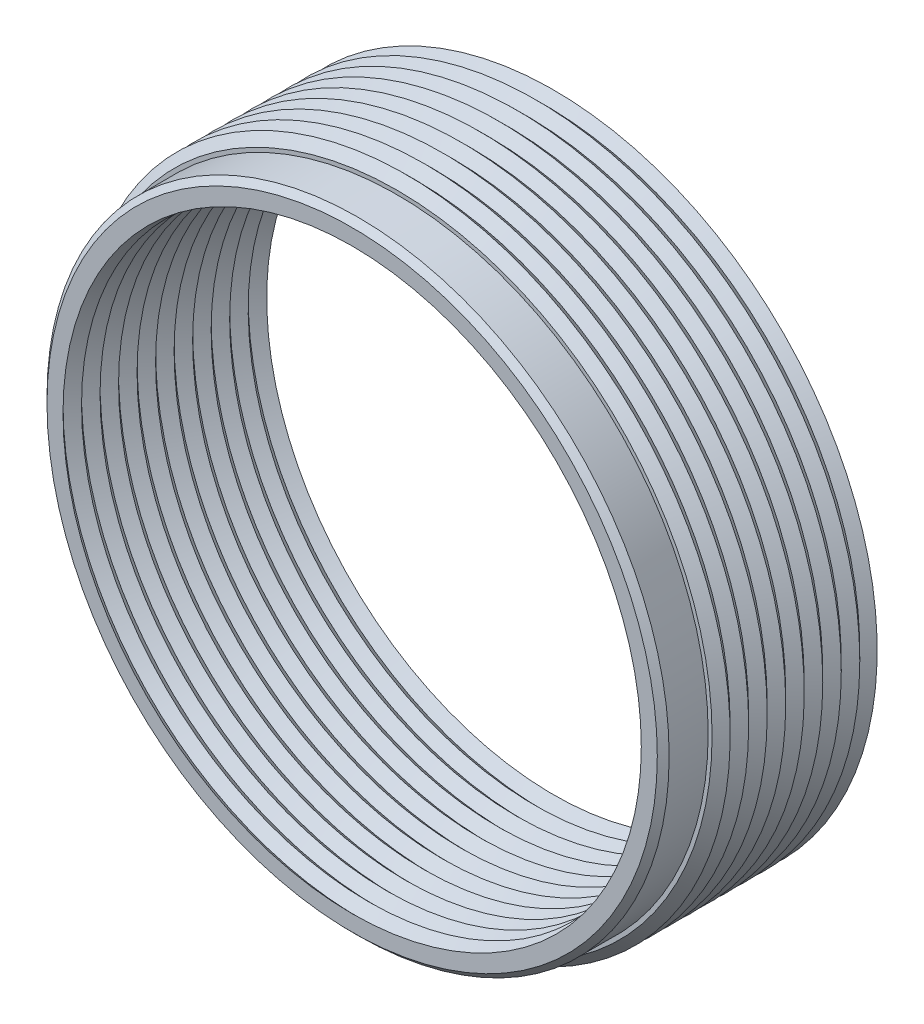
ISO-10303-21;
HEADER;
FILE_DESCRIPTION(('STEP AP214'),'2;1');
FILE_NAME('part.step','',(''),(''),'','','');
FILE_SCHEMA(('AUTOMOTIVE_DESIGN { 1 0 10303 214 1 1 1 1 }'));
ENDSEC;
DATA;
#1=APPLICATION_CONTEXT('core data for automotive mechanical design processes');
#2=APPLICATION_PROTOCOL_DEFINITION('international standard','automotive_design',2000,#1);
#3=PRODUCT_CONTEXT('',#1,'mechanical');
#4=PRODUCT('Part','Part','',(#3));
#5=PRODUCT_RELATED_PRODUCT_CATEGORY('part','',(#4));
#6=PRODUCT_DEFINITION_FORMATION('','',#4);
#7=PRODUCT_DEFINITION_CONTEXT('part definition',#1,'design');
#8=PRODUCT_DEFINITION('design','',#6,#7);
#9=PRODUCT_DEFINITION_SHAPE('','',#8);
#10=(LENGTH_UNIT() NAMED_UNIT(*) SI_UNIT(.MILLI.,.METRE.));
#11=(NAMED_UNIT(*) PLANE_ANGLE_UNIT() SI_UNIT($,.RADIAN.));
#12=(NAMED_UNIT(*) SI_UNIT($,.STERADIAN.) SOLID_ANGLE_UNIT());
#13=UNCERTAINTY_MEASURE_WITH_UNIT(LENGTH_MEASURE(1.E-05),#10,'distance_accuracy_value','');
#14=(GEOMETRIC_REPRESENTATION_CONTEXT(3) GLOBAL_UNCERTAINTY_ASSIGNED_CONTEXT((#13)) GLOBAL_UNIT_ASSIGNED_CONTEXT((#10,
#11,#12)) REPRESENTATION_CONTEXT('',''));
#15=CARTESIAN_POINT('',(0.,0.,0.));
#16=DIRECTION('',(0.,0.,1.));
#17=DIRECTION('',(1.,0.,0.));
#18=AXIS2_PLACEMENT_3D('',#15,#16,#17);
#19=CARTESIAN_POINT('',(0.,0.,8.33437499999999));
#20=DIRECTION('',(0.,0.,-1.));
#21=DIRECTION('',(-1.,0.,0.));
#22=AXIS2_PLACEMENT_3D('',#19,#20,#21);
#23=CONICAL_SURFACE('',#22,12.7,0.785398163397448);
#24=CARTESIAN_POINT('',(0.,0.,8.33437499999999));
#25=DIRECTION('',(0.,0.,1.));
#26=DIRECTION('',(1.,0.,0.));
#27=AXIS2_PLACEMENT_3D('',#24,#25,#26);
#28=CIRCLE('',#27,12.7);
#29=CARTESIAN_POINT('',(12.7,0.,8.33437499999999));
#30=VERTEX_POINT('',#29);
#31=EDGE_CURVE('E30',#30,#30,#28,.F.);
#32=ORIENTED_EDGE('',*,*,#31,.T.);
#33=EDGE_LOOP('',(#32));
#34=FACE_BOUND('',#33,.T.);
#35=CARTESIAN_POINT('',(0.,0.,8.63979999999999));
#36=DIRECTION('',(0.,0.,-1.));
#37=DIRECTION('',(-1.,0.,0.));
#38=AXIS2_PLACEMENT_3D('',#35,#36,#37);
#39=CIRCLE('',#38,12.394575);
#40=CARTESIAN_POINT('',(-12.394575,0.,8.63979999999999));
#41=VERTEX_POINT('',#40);
#42=EDGE_CURVE('E18',#41,#41,#39,.T.);
#43=ORIENTED_EDGE('',*,*,#42,.F.);
#44=EDGE_LOOP('',(#43));
#45=FACE_BOUND('',#44,.T.);
#46=ADVANCED_FACE('F15',(#34,#45),#23,.F.);
#47=CARTESIAN_POINT('',(0.,0.,8.33437499999999));
#48=DIRECTION('',(0.,0.,1.));
#49=DIRECTION('',(1.,0.,0.));
#50=AXIS2_PLACEMENT_3D('',#47,#48,#49);
#51=CONICAL_SURFACE('',#50,12.7,0.785398163397448);
#52=ORIENTED_EDGE('',*,*,#31,.F.);
#53=EDGE_LOOP('',(#52));
#54=FACE_BOUND('',#53,.T.);
#55=CARTESIAN_POINT('',(0.,0.,7.93749999999999));
#56=DIRECTION('',(0.,0.,-1.));
#57=DIRECTION('',(0.,1.,0.));
#58=AXIS2_PLACEMENT_3D('',#55,#56,#57);
#59=CIRCLE('',#58,12.303125);
#60=CARTESIAN_POINT('',(0.,12.303125,7.93749999999999));
#61=VERTEX_POINT('',#60);
#62=EDGE_CURVE('E44',#61,#61,#59,.T.);
#63=ORIENTED_EDGE('',*,*,#62,.T.);
#64=EDGE_LOOP('',(#63));
#65=FACE_BOUND('',#64,.T.);
#66=ADVANCED_FACE('F600',(#54,#65),#51,.F.);
#67=CARTESIAN_POINT('',(0.,0.,8.63979999999999));
#68=DIRECTION('',(0.,0.,1.));
#69=DIRECTION('',(1.,0.,0.));
#70=AXIS2_PLACEMENT_3D('',#67,#68,#69);
#71=PLANE('',#70);
#72=CARTESIAN_POINT('',(0.,0.,8.63979999999999));
#73=DIRECTION('',(0.,0.,-1.));
#74=DIRECTION('',(-1.,0.,0.));
#75=AXIS2_PLACEMENT_3D('',#72,#73,#74);
#76=CIRCLE('',#75,13.081);
#77=CARTESIAN_POINT('',(-13.081,0.,8.63979999999999));
#78=VERTEX_POINT('',#77);
#79=EDGE_CURVE('E41',#78,#78,#76,.T.);
#80=ORIENTED_EDGE('',*,*,#79,.F.);
#81=EDGE_LOOP('',(#80));
#82=FACE_BOUND('',#81,.T.);
#83=ORIENTED_EDGE('',*,*,#42,.T.);
#84=EDGE_LOOP('',(#83));
#85=FACE_BOUND('',#84,.T.);
#86=ADVANCED_FACE('F590',(#82,#85),#71,.T.);
#87=CARTESIAN_POINT('',(0.,0.,7.54062499999999));
#88=DIRECTION('',(0.,0.,-1.));
#89=DIRECTION('',(-1.,0.,0.));
#90=AXIS2_PLACEMENT_3D('',#87,#88,#89);
#91=CONICAL_SURFACE('',#90,12.7,0.785398163397448);
#92=CARTESIAN_POINT('',(0.,0.,7.54062499999999));
#93=DIRECTION('',(0.,0.,1.));
#94=DIRECTION('',(1.,0.,0.));
#95=AXIS2_PLACEMENT_3D('',#92,#93,#94);
#96=CIRCLE('',#95,12.7);
#97=CARTESIAN_POINT('',(12.7,0.,7.54062499999999));
#98=VERTEX_POINT('',#97);
#99=EDGE_CURVE('E43',#98,#98,#96,.F.);
#100=ORIENTED_EDGE('',*,*,#99,.T.);
#101=EDGE_LOOP('',(#100));
#102=FACE_BOUND('',#101,.T.);
#103=ORIENTED_EDGE('',*,*,#62,.F.);
#104=EDGE_LOOP('',(#103));
#105=FACE_BOUND('',#104,.T.);
#106=ADVANCED_FACE('F580',(#102,#105),#91,.F.);
#107=CARTESIAN_POINT('',(0.,0.,8.38579999999999));
#108=DIRECTION('',(0.,0.,-1.));
#109=DIRECTION('',(-1.,0.,0.));
#110=AXIS2_PLACEMENT_3D('',#107,#108,#109);
#111=CONICAL_SURFACE('',#110,13.335,0.785398163397445);
#112=CARTESIAN_POINT('',(0.,0.,8.38579999999999));
#113=DIRECTION('',(0.,0.,1.));
#114=DIRECTION('',(1.,0.,0.));
#115=AXIS2_PLACEMENT_3D('',#112,#113,#114);
#116=CIRCLE('',#115,13.335);
#117=CARTESIAN_POINT('',(13.335,0.,8.38579999999999));
#118=VERTEX_POINT('',#117);
#119=EDGE_CURVE('E48',#118,#118,#116,.F.);
#120=ORIENTED_EDGE('',*,*,#119,.F.);
#121=EDGE_LOOP('',(#120));
#122=FACE_BOUND('',#121,.T.);
#123=ORIENTED_EDGE('',*,*,#79,.T.);
#124=EDGE_LOOP('',(#123));
#125=FACE_BOUND('',#124,.T.);
#126=ADVANCED_FACE('F570',(#122,#125),#111,.T.);
#127=CARTESIAN_POINT('',(0.,0.,7.54062499999999));
#128=DIRECTION('',(0.,0.,1.));
#129=DIRECTION('',(1.,0.,0.));
#130=AXIS2_PLACEMENT_3D('',#127,#128,#129);
#131=CONICAL_SURFACE('',#130,12.7,0.785398163397448);
#132=ORIENTED_EDGE('',*,*,#99,.F.);
#133=EDGE_LOOP('',(#132));
#134=FACE_BOUND('',#133,.T.);
#135=CARTESIAN_POINT('',(0.,0.,7.14374999999999));
#136=DIRECTION('',(0.,0.,-1.));
#137=DIRECTION('',(0.,1.,0.));
#138=AXIS2_PLACEMENT_3D('',#135,#136,#137);
#139=CIRCLE('',#138,12.303125);
#140=CARTESIAN_POINT('',(0.,12.303125,7.14374999999999));
#141=VERTEX_POINT('',#140);
#142=EDGE_CURVE('E40',#141,#141,#139,.T.);
#143=ORIENTED_EDGE('',*,*,#142,.T.);
#144=EDGE_LOOP('',(#143));
#145=FACE_BOUND('',#144,.T.);
#146=ADVANCED_FACE('F560',(#134,#145),#131,.F.);
#147=CARTESIAN_POINT('',(0.,0.,6.71359999999999));
#148=DIRECTION('',(0.,0.,1.));
#149=DIRECTION('',(1.,0.,0.));
#150=AXIS2_PLACEMENT_3D('',#147,#148,#149);
#151=CYLINDRICAL_SURFACE('',#150,13.335);
#152=ORIENTED_EDGE('',*,*,#119,.T.);
#153=EDGE_LOOP('',(#152));
#154=FACE_BOUND('',#153,.T.);
#155=CARTESIAN_POINT('',(0.,0.,6.71359999999999));
#156=DIRECTION('',(0.,0.,1.));
#157=DIRECTION('',(1.,0.,0.));
#158=AXIS2_PLACEMENT_3D('',#155,#156,#157);
#159=CIRCLE('',#158,13.335);
#160=CARTESIAN_POINT('',(13.335,0.,6.71359999999999));
#161=VERTEX_POINT('',#160);
#162=EDGE_CURVE('E38',#161,#161,#159,.F.);
#163=ORIENTED_EDGE('',*,*,#162,.F.);
#164=EDGE_LOOP('',(#163));
#165=FACE_BOUND('',#164,.T.);
#166=ADVANCED_FACE('F550',(#154,#165),#151,.T.);
#167=CARTESIAN_POINT('',(0.,0.,6.74687499999999));
#168=DIRECTION('',(0.,0.,-1.));
#169=DIRECTION('',(0.,1.,0.));
#170=AXIS2_PLACEMENT_3D('',#167,#168,#169);
#171=CONICAL_SURFACE('',#170,12.7,0.785398163397447);
#172=CARTESIAN_POINT('',(0.,0.,6.74687499999999));
#173=DIRECTION('',(0.,0.,1.));
#174=DIRECTION('',(1.,0.,0.));
#175=AXIS2_PLACEMENT_3D('',#172,#173,#174);
#176=CIRCLE('',#175,12.7);
#177=CARTESIAN_POINT('',(12.7,0.,6.74687499999999));
#178=VERTEX_POINT('',#177);
#179=EDGE_CURVE('E37',#178,#178,#176,.F.);
#180=ORIENTED_EDGE('',*,*,#179,.T.);
#181=EDGE_LOOP('',(#180));
#182=FACE_BOUND('',#181,.T.);
#183=ORIENTED_EDGE('',*,*,#142,.F.);
#184=EDGE_LOOP('',(#183));
#185=FACE_BOUND('',#184,.T.);
#186=ADVANCED_FACE('F540',(#182,#185),#171,.F.);
#187=CARTESIAN_POINT('',(0.,0.,6.71359999999999));
#188=DIRECTION('',(0.,0.,1.));
#189=DIRECTION('',(1.,0.,0.));
#190=AXIS2_PLACEMENT_3D('',#187,#188,#189);
#191=PLANE('',#190);
#192=ORIENTED_EDGE('',*,*,#162,.T.);
#193=EDGE_LOOP('',(#192));
#194=FACE_BOUND('',#193,.T.);
#195=CARTESIAN_POINT('',(0.,0.,6.71359999999999));
#196=DIRECTION('',(0.,0.,-1.));
#197=DIRECTION('',(-1.,0.,0.));
#198=AXIS2_PLACEMENT_3D('',#195,#196,#197);
#199=CIRCLE('',#198,13.503275);
#200=CARTESIAN_POINT('',(-13.503275,0.,6.71359999999999));
#201=VERTEX_POINT('',#200);
#202=EDGE_CURVE('E33',#201,#201,#199,.T.);
#203=ORIENTED_EDGE('',*,*,#202,.F.);
#204=EDGE_LOOP('',(#203));
#205=FACE_BOUND('',#204,.T.);
#206=ADVANCED_FACE('F530',(#194,#205),#191,.T.);
#207=CARTESIAN_POINT('',(0.,0.,6.74687499999999));
#208=DIRECTION('',(0.,0.,1.));
#209=DIRECTION('',(1.,0.,0.));
#210=AXIS2_PLACEMENT_3D('',#207,#208,#209);
#211=CONICAL_SURFACE('',#210,12.7,0.785398163397448);
#212=ORIENTED_EDGE('',*,*,#179,.F.);
#213=EDGE_LOOP('',(#212));
#214=FACE_BOUND('',#213,.T.);
#215=CARTESIAN_POINT('',(0.,0.,6.34999999999999));
#216=DIRECTION('',(0.,0.,-1.));
#217=DIRECTION('',(-1.,0.,0.));
#218=AXIS2_PLACEMENT_3D('',#215,#216,#217);
#219=CIRCLE('',#218,12.303125);
#220=CARTESIAN_POINT('',(-12.303125,0.,6.34999999999999));
#221=VERTEX_POINT('',#220);
#222=EDGE_CURVE('E36',#221,#221,#219,.T.);
#223=ORIENTED_EDGE('',*,*,#222,.T.);
#224=EDGE_LOOP('',(#223));
#225=FACE_BOUND('',#224,.T.);
#226=ADVANCED_FACE('F520',(#214,#225),#211,.F.);
#227=CARTESIAN_POINT('',(0.,0.,6.32625));
#228=DIRECTION('',(0.,0.,-1.));
#229=DIRECTION('',(-1.,0.,0.));
#230=AXIS2_PLACEMENT_3D('',#227,#228,#229);
#231=CONICAL_SURFACE('',#230,13.890625,0.78539816339745);
#232=ORIENTED_EDGE('',*,*,#202,.T.);
#233=EDGE_LOOP('',(#232));
#234=FACE_BOUND('',#233,.T.);
#235=CARTESIAN_POINT('',(0.,0.,6.32625));
#236=DIRECTION('',(0.,0.,1.));
#237=DIRECTION('',(0.,-1.,0.));
#238=AXIS2_PLACEMENT_3D('',#235,#236,#237);
#239=CIRCLE('',#238,13.890625);
#240=CARTESIAN_POINT('',(0.,-13.890625,6.32625));
#241=VERTEX_POINT('',#240);
#242=EDGE_CURVE('E63',#241,#241,#239,.F.);
#243=ORIENTED_EDGE('',*,*,#242,.F.);
#244=EDGE_LOOP('',(#243));
#245=FACE_BOUND('',#244,.T.);
#246=ADVANCED_FACE('F510',(#234,#245),#231,.T.);
#247=CARTESIAN_POINT('',(0.,0.,5.95312499999999));
#248=DIRECTION('',(0.,0.,-1.));
#249=DIRECTION('',(-1.,0.,0.));
#250=AXIS2_PLACEMENT_3D('',#247,#248,#249);
#251=CONICAL_SURFACE('',#250,12.7,0.785398163397446);
#252=CARTESIAN_POINT('',(0.,0.,5.95312499999999));
#253=DIRECTION('',(0.,0.,1.));
#254=DIRECTION('',(1.,0.,0.));
#255=AXIS2_PLACEMENT_3D('',#252,#253,#254);
#256=CIRCLE('',#255,12.7);
#257=CARTESIAN_POINT('',(12.7,0.,5.95312499999999));
#258=VERTEX_POINT('',#257);
#259=EDGE_CURVE('E66',#258,#258,#256,.F.);
#260=ORIENTED_EDGE('',*,*,#259,.T.);
#261=EDGE_LOOP('',(#260));
#262=FACE_BOUND('',#261,.T.);
#263=ORIENTED_EDGE('',*,*,#222,.F.);
#264=EDGE_LOOP('',(#263));
#265=FACE_BOUND('',#264,.T.);
#266=ADVANCED_FACE('F500',(#262,#265),#251,.F.);
#267=CARTESIAN_POINT('',(0.,0.,6.32625));
#268=DIRECTION('',(0.,0.,1.));
#269=DIRECTION('',(1.,0.,0.));
#270=AXIS2_PLACEMENT_3D('',#267,#268,#269);
#271=CONICAL_SURFACE('',#270,13.890625,0.785398163397457);
#272=ORIENTED_EDGE('',*,*,#242,.T.);
#273=EDGE_LOOP('',(#272));
#274=FACE_BOUND('',#273,.T.);
#275=CARTESIAN_POINT('',(0.,0.,5.929375));
#276=DIRECTION('',(0.,0.,-1.));
#277=DIRECTION('',(0.,1.,0.));
#278=AXIS2_PLACEMENT_3D('',#275,#276,#277);
#279=CIRCLE('',#278,13.49375);
#280=CARTESIAN_POINT('',(0.,13.49375,5.929375));
#281=VERTEX_POINT('',#280);
#282=EDGE_CURVE('E69',#281,#281,#279,.T.);
#283=ORIENTED_EDGE('',*,*,#282,.F.);
#284=EDGE_LOOP('',(#283));
#285=FACE_BOUND('',#284,.T.);
#286=ADVANCED_FACE('F490',(#274,#285),#271,.T.);
#287=CARTESIAN_POINT('',(0.,0.,5.95312499999999));
#288=DIRECTION('',(0.,0.,1.));
#289=DIRECTION('',(1.,0.,0.));
#290=AXIS2_PLACEMENT_3D('',#287,#288,#289);
#291=CONICAL_SURFACE('',#290,12.7,0.785398163397447);
#292=ORIENTED_EDGE('',*,*,#259,.F.);
#293=EDGE_LOOP('',(#292));
#294=FACE_BOUND('',#293,.T.);
#295=CARTESIAN_POINT('',(0.,0.,5.55624999999999));
#296=DIRECTION('',(0.,0.,-1.));
#297=DIRECTION('',(-1.,0.,0.));
#298=AXIS2_PLACEMENT_3D('',#295,#296,#297);
#299=CIRCLE('',#298,12.303125);
#300=CARTESIAN_POINT('',(-12.303125,0.,5.55624999999999));
#301=VERTEX_POINT('',#300);
#302=EDGE_CURVE('E72',#301,#301,#299,.T.);
#303=ORIENTED_EDGE('',*,*,#302,.T.);
#304=EDGE_LOOP('',(#303));
#305=FACE_BOUND('',#304,.T.);
#306=ADVANCED_FACE('F480',(#294,#305),#291,.F.);
#307=CARTESIAN_POINT('',(0.,0.,5.5325));
#308=DIRECTION('',(0.,0.,-1.));
#309=DIRECTION('',(0.,1.,0.));
#310=AXIS2_PLACEMENT_3D('',#307,#308,#309);
#311=CONICAL_SURFACE('',#310,13.890625,0.785398163397448);
#312=CARTESIAN_POINT('',(0.,0.,5.53249999999999));
#313=DIRECTION('',(0.,0.,1.));
#314=DIRECTION('',(1.,0.,0.));
#315=AXIS2_PLACEMENT_3D('',#312,#313,#314);
#316=CIRCLE('',#315,13.890625);
#317=CARTESIAN_POINT('',(13.890625,0.,5.53249999999999));
#318=VERTEX_POINT('',#317);
#319=EDGE_CURVE('E75',#318,#318,#316,.F.);
#320=ORIENTED_EDGE('',*,*,#319,.F.);
#321=EDGE_LOOP('',(#320));
#322=FACE_BOUND('',#321,.T.);
#323=ORIENTED_EDGE('',*,*,#282,.T.);
#324=EDGE_LOOP('',(#323));
#325=FACE_BOUND('',#324,.T.);
#326=ADVANCED_FACE('F470',(#322,#325),#311,.T.);
#327=CARTESIAN_POINT('',(0.,0.,5.15937499999999));
#328=DIRECTION('',(0.,0.,-1.));
#329=DIRECTION('',(-1.,0.,0.));
#330=AXIS2_PLACEMENT_3D('',#327,#328,#329);
#331=CONICAL_SURFACE('',#330,12.7,0.785398163397449);
#332=CARTESIAN_POINT('',(0.,0.,5.15937499999999));
#333=DIRECTION('',(0.,0.,1.));
#334=DIRECTION('',(1.,0.,0.));
#335=AXIS2_PLACEMENT_3D('',#332,#333,#334);
#336=CIRCLE('',#335,12.7);
#337=CARTESIAN_POINT('',(12.7,0.,5.15937499999999));
#338=VERTEX_POINT('',#337);
#339=EDGE_CURVE('E78',#338,#338,#336,.F.);
#340=ORIENTED_EDGE('',*,*,#339,.T.);
#341=EDGE_LOOP('',(#340));
#342=FACE_BOUND('',#341,.T.);
#343=ORIENTED_EDGE('',*,*,#302,.F.);
#344=EDGE_LOOP('',(#343));
#345=FACE_BOUND('',#344,.T.);
#346=ADVANCED_FACE('F460',(#342,#345),#331,.F.);
#347=CARTESIAN_POINT('',(0.,0.,5.5325));
#348=DIRECTION('',(0.,0.,1.));
#349=DIRECTION('',(1.,0.,0.));
#350=AXIS2_PLACEMENT_3D('',#347,#348,#349);
#351=CONICAL_SURFACE('',#350,13.890625,0.785398163397457);
#352=ORIENTED_EDGE('',*,*,#319,.T.);
#353=EDGE_LOOP('',(#352));
#354=FACE_BOUND('',#353,.T.);
#355=CARTESIAN_POINT('',(0.,0.,5.135625));
#356=DIRECTION('',(0.,0.,-1.));
#357=DIRECTION('',(-1.,0.,0.));
#358=AXIS2_PLACEMENT_3D('',#355,#356,#357);
#359=CIRCLE('',#358,13.49375);
#360=CARTESIAN_POINT('',(-13.49375,0.,5.135625));
#361=VERTEX_POINT('',#360);
#362=EDGE_CURVE('E81',#361,#361,#359,.T.);
#363=ORIENTED_EDGE('',*,*,#362,.F.);
#364=EDGE_LOOP('',(#363));
#365=FACE_BOUND('',#364,.T.);
#366=ADVANCED_FACE('F450',(#354,#365),#351,.T.);
#367=CARTESIAN_POINT('',(0.,0.,5.15937499999999));
#368=DIRECTION('',(0.,0.,1.));
#369=DIRECTION('',(1.,0.,0.));
#370=AXIS2_PLACEMENT_3D('',#367,#368,#369);
#371=CONICAL_SURFACE('',#370,12.7,0.785398163397449);
#372=ORIENTED_EDGE('',*,*,#339,.F.);
#373=EDGE_LOOP('',(#372));
#374=FACE_BOUND('',#373,.T.);
#375=CARTESIAN_POINT('',(0.,0.,4.76249999999999));
#376=DIRECTION('',(0.,0.,-1.));
#377=DIRECTION('',(-1.,0.,0.));
#378=AXIS2_PLACEMENT_3D('',#375,#376,#377);
#379=CIRCLE('',#378,12.303125);
#380=CARTESIAN_POINT('',(-12.303125,0.,4.76249999999999));
#381=VERTEX_POINT('',#380);
#382=EDGE_CURVE('E84',#381,#381,#379,.T.);
#383=ORIENTED_EDGE('',*,*,#382,.T.);
#384=EDGE_LOOP('',(#383));
#385=FACE_BOUND('',#384,.T.);
#386=ADVANCED_FACE('F440',(#374,#385),#371,.F.);
#387=CARTESIAN_POINT('',(0.,0.,4.73875));
#388=DIRECTION('',(0.,0.,-1.));
#389=DIRECTION('',(-1.,0.,0.));
#390=AXIS2_PLACEMENT_3D('',#387,#388,#389);
#391=CONICAL_SURFACE('',#390,13.890625,0.78539816339745);
#392=CARTESIAN_POINT('',(0.,0.,4.73875));
#393=DIRECTION('',(0.,0.,1.));
#394=DIRECTION('',(1.,0.,0.));
#395=AXIS2_PLACEMENT_3D('',#392,#393,#394);
#396=CIRCLE('',#395,13.890625);
#397=CARTESIAN_POINT('',(13.890625,0.,4.73875));
#398=VERTEX_POINT('',#397);
#399=EDGE_CURVE('E87',#398,#398,#396,.F.);
#400=ORIENTED_EDGE('',*,*,#399,.F.);
#401=EDGE_LOOP('',(#400));
#402=FACE_BOUND('',#401,.T.);
#403=ORIENTED_EDGE('',*,*,#362,.T.);
#404=EDGE_LOOP('',(#403));
#405=FACE_BOUND('',#404,.T.);
#406=ADVANCED_FACE('F430',(#402,#405),#391,.T.);
#407=CARTESIAN_POINT('',(0.,0.,4.36562499999999));
#408=DIRECTION('',(0.,0.,-1.));
#409=DIRECTION('',(-1.,0.,0.));
#410=AXIS2_PLACEMENT_3D('',#407,#408,#409);
#411=CONICAL_SURFACE('',#410,12.7,0.785398163397449);
#412=CARTESIAN_POINT('',(0.,0.,4.36562499999999));
#413=DIRECTION('',(0.,0.,1.));
#414=DIRECTION('',(1.,0.,0.));
#415=AXIS2_PLACEMENT_3D('',#412,#413,#414);
#416=CIRCLE('',#415,12.7);
#417=CARTESIAN_POINT('',(12.7,0.,4.36562499999999));
#418=VERTEX_POINT('',#417);
#419=EDGE_CURVE('E90',#418,#418,#416,.F.);
#420=ORIENTED_EDGE('',*,*,#419,.T.);
#421=EDGE_LOOP('',(#420));
#422=FACE_BOUND('',#421,.T.);
#423=ORIENTED_EDGE('',*,*,#382,.F.);
#424=EDGE_LOOP('',(#423));
#425=FACE_BOUND('',#424,.T.);
#426=ADVANCED_FACE('F420',(#422,#425),#411,.F.);
#427=CARTESIAN_POINT('',(0.,0.,4.73874999999999));
#428=DIRECTION('',(0.,0.,1.));
#429=DIRECTION('',(1.,0.,0.));
#430=AXIS2_PLACEMENT_3D('',#427,#428,#429);
#431=CONICAL_SURFACE('',#430,13.890625,0.785398163397456);
#432=ORIENTED_EDGE('',*,*,#399,.T.);
#433=EDGE_LOOP('',(#432));
#434=FACE_BOUND('',#433,.T.);
#435=CARTESIAN_POINT('',(0.,0.,4.341875));
#436=DIRECTION('',(0.,0.,-1.));
#437=DIRECTION('',(-1.,0.,0.));
#438=AXIS2_PLACEMENT_3D('',#435,#436,#437);
#439=CIRCLE('',#438,13.49375);
#440=CARTESIAN_POINT('',(-13.49375,0.,4.341875));
#441=VERTEX_POINT('',#440);
#442=EDGE_CURVE('E93',#441,#441,#439,.T.);
#443=ORIENTED_EDGE('',*,*,#442,.F.);
#444=EDGE_LOOP('',(#443));
#445=FACE_BOUND('',#444,.T.);
#446=ADVANCED_FACE('F410',(#434,#445),#431,.T.);
#447=CARTESIAN_POINT('',(0.,0.,4.36562499999999));
#448=DIRECTION('',(0.,0.,1.));
#449=DIRECTION('',(1.,0.,0.));
#450=AXIS2_PLACEMENT_3D('',#447,#448,#449);
#451=CONICAL_SURFACE('',#450,12.7,0.785398163397449);
#452=ORIENTED_EDGE('',*,*,#419,.F.);
#453=EDGE_LOOP('',(#452));
#454=FACE_BOUND('',#453,.T.);
#455=CARTESIAN_POINT('',(0.,0.,3.96874999999999));
#456=DIRECTION('',(0.,0.,-1.));
#457=DIRECTION('',(-1.,0.,0.));
#458=AXIS2_PLACEMENT_3D('',#455,#456,#457);
#459=CIRCLE('',#458,12.303125);
#460=CARTESIAN_POINT('',(-12.303125,0.,3.96874999999999));
#461=VERTEX_POINT('',#460);
#462=EDGE_CURVE('E96',#461,#461,#459,.T.);
#463=ORIENTED_EDGE('',*,*,#462,.T.);
#464=EDGE_LOOP('',(#463));
#465=FACE_BOUND('',#464,.T.);
#466=ADVANCED_FACE('F400',(#454,#465),#451,.F.);
#467=CARTESIAN_POINT('',(0.,0.,3.94499999999999));
#468=DIRECTION('',(0.,0.,-1.));
#469=DIRECTION('',(0.,1.,0.));
#470=AXIS2_PLACEMENT_3D('',#467,#468,#469);
#471=CONICAL_SURFACE('',#470,13.890625,0.785398163397449);
#472=CARTESIAN_POINT('',(0.,0.,3.94499999999999));
#473=DIRECTION('',(0.,0.,1.));
#474=DIRECTION('',(0.,-1.,0.));
#475=AXIS2_PLACEMENT_3D('',#472,#473,#474);
#476=CIRCLE('',#475,13.890625);
#477=CARTESIAN_POINT('',(0.,-13.890625,3.94499999999999));
#478=VERTEX_POINT('',#477);
#479=EDGE_CURVE('E99',#478,#478,#476,.F.);
#480=ORIENTED_EDGE('',*,*,#479,.F.);
#481=EDGE_LOOP('',(#480));
#482=FACE_BOUND('',#481,.T.);
#483=ORIENTED_EDGE('',*,*,#442,.T.);
#484=EDGE_LOOP('',(#483));
#485=FACE_BOUND('',#484,.T.);
#486=ADVANCED_FACE('F390',(#482,#485),#471,.T.);
#487=CARTESIAN_POINT('',(0.,0.,3.57187499999999));
#488=DIRECTION('',(0.,0.,-1.));
#489=DIRECTION('',(0.,1.,0.));
#490=AXIS2_PLACEMENT_3D('',#487,#488,#489);
#491=CONICAL_SURFACE('',#490,12.7,0.785398163397449);
#492=CARTESIAN_POINT('',(0.,0.,3.57187499999999));
#493=DIRECTION('',(0.,0.,1.));
#494=DIRECTION('',(0.,-1.,0.));
#495=AXIS2_PLACEMENT_3D('',#492,#493,#494);
#496=CIRCLE('',#495,12.7);
#497=CARTESIAN_POINT('',(0.,-12.7,3.57187499999999));
#498=VERTEX_POINT('',#497);
#499=EDGE_CURVE('E102',#498,#498,#496,.F.);
#500=ORIENTED_EDGE('',*,*,#499,.T.);
#501=EDGE_LOOP('',(#500));
#502=FACE_BOUND('',#501,.T.);
#503=ORIENTED_EDGE('',*,*,#462,.F.);
#504=EDGE_LOOP('',(#503));
#505=FACE_BOUND('',#504,.T.);
#506=ADVANCED_FACE('F380',(#502,#505),#491,.F.);
#507=CARTESIAN_POINT('',(0.,0.,3.945));
#508=DIRECTION('',(0.,0.,1.));
#509=DIRECTION('',(0.,-1.,0.));
#510=AXIS2_PLACEMENT_3D('',#507,#508,#509);
#511=CONICAL_SURFACE('',#510,13.890625,0.785398163397458);
#512=CARTESIAN_POINT('',(0.,0.,3.548125));
#513=DIRECTION('',(0.,0.,-1.));
#514=DIRECTION('',(-1.,0.,0.));
#515=AXIS2_PLACEMENT_3D('',#512,#513,#514);
#516=CIRCLE('',#515,13.49375);
#517=CARTESIAN_POINT('',(-13.49375,0.,3.548125));
#518=VERTEX_POINT('',#517);
#519=EDGE_CURVE('E105',#518,#518,#516,.T.);
#520=ORIENTED_EDGE('',*,*,#519,.F.);
#521=EDGE_LOOP('',(#520));
#522=FACE_BOUND('',#521,.T.);
#523=ORIENTED_EDGE('',*,*,#479,.T.);
#524=EDGE_LOOP('',(#523));
#525=FACE_BOUND('',#524,.T.);
#526=ADVANCED_FACE('F370',(#522,#525),#511,.T.);
#527=CARTESIAN_POINT('',(0.,0.,3.57187499999999));
#528=DIRECTION('',(0.,0.,1.));
#529=DIRECTION('',(1.,0.,0.));
#530=AXIS2_PLACEMENT_3D('',#527,#528,#529);
#531=CONICAL_SURFACE('',#530,12.7,0.785398163397448);
#532=CARTESIAN_POINT('',(0.,0.,3.17499999999999));
#533=DIRECTION('',(0.,0.,-1.));
#534=DIRECTION('',(-1.,0.,0.));
#535=AXIS2_PLACEMENT_3D('',#532,#533,#534);
#536=CIRCLE('',#535,12.303125);
#537=CARTESIAN_POINT('',(-12.303125,0.,3.17499999999999));
#538=VERTEX_POINT('',#537);
#539=EDGE_CURVE('E108',#538,#538,#536,.T.);
#540=ORIENTED_EDGE('',*,*,#539,.T.);
#541=EDGE_LOOP('',(#540));
#542=FACE_BOUND('',#541,.T.);
#543=ORIENTED_EDGE('',*,*,#499,.F.);
#544=EDGE_LOOP('',(#543));
#545=FACE_BOUND('',#544,.T.);
#546=ADVANCED_FACE('F360',(#542,#545),#531,.F.);
#547=CARTESIAN_POINT('',(0.,0.,3.15124999999999));
#548=DIRECTION('',(0.,0.,-1.));
#549=DIRECTION('',(0.,1.,0.));
#550=AXIS2_PLACEMENT_3D('',#547,#548,#549);
#551=CONICAL_SURFACE('',#550,13.890625,0.785398163397448);
#552=CARTESIAN_POINT('',(0.,0.,3.15125));
#553=DIRECTION('',(0.,0.,1.));
#554=DIRECTION('',(0.,-1.,0.));
#555=AXIS2_PLACEMENT_3D('',#552,#553,#554);
#556=CIRCLE('',#555,13.890625);
#557=CARTESIAN_POINT('',(0.,-13.890625,3.15125));
#558=VERTEX_POINT('',#557);
#559=EDGE_CURVE('E111',#558,#558,#556,.F.);
#560=ORIENTED_EDGE('',*,*,#559,.F.);
#561=EDGE_LOOP('',(#560));
#562=FACE_BOUND('',#561,.T.);
#563=ORIENTED_EDGE('',*,*,#519,.T.);
#564=EDGE_LOOP('',(#563));
#565=FACE_BOUND('',#564,.T.);
#566=ADVANCED_FACE('F350',(#562,#565),#551,.T.);
#567=CARTESIAN_POINT('',(0.,0.,2.77812499999999));
#568=DIRECTION('',(0.,0.,-1.));
#569=DIRECTION('',(-1.,0.,0.));
#570=AXIS2_PLACEMENT_3D('',#567,#568,#569);
#571=CONICAL_SURFACE('',#570,12.7,0.785398163397449);
#572=CARTESIAN_POINT('',(0.,0.,2.77812499999999));
#573=DIRECTION('',(0.,0.,1.));
#574=DIRECTION('',(1.,0.,0.));
#575=AXIS2_PLACEMENT_3D('',#572,#573,#574);
#576=CIRCLE('',#575,12.7);
#577=CARTESIAN_POINT('',(12.7,0.,2.77812499999999));
#578=VERTEX_POINT('',#577);
#579=EDGE_CURVE('E114',#578,#578,#576,.F.);
#580=ORIENTED_EDGE('',*,*,#579,.T.);
#581=EDGE_LOOP('',(#580));
#582=FACE_BOUND('',#581,.T.);
#583=ORIENTED_EDGE('',*,*,#539,.F.);
#584=EDGE_LOOP('',(#583));
#585=FACE_BOUND('',#584,.T.);
#586=ADVANCED_FACE('F340',(#582,#585),#571,.F.);
#587=CARTESIAN_POINT('',(0.,0.,3.15125));
#588=DIRECTION('',(0.,0.,1.));
#589=DIRECTION('',(0.,-1.,0.));
#590=AXIS2_PLACEMENT_3D('',#587,#588,#589);
#591=CONICAL_SURFACE('',#590,13.890625,0.785398163397457);
#592=CARTESIAN_POINT('',(0.,0.,2.754375));
#593=DIRECTION('',(0.,0.,-1.));
#594=DIRECTION('',(-1.,0.,0.));
#595=AXIS2_PLACEMENT_3D('',#592,#593,#594);
#596=CIRCLE('',#595,13.49375);
#597=CARTESIAN_POINT('',(-13.49375,0.,2.754375));
#598=VERTEX_POINT('',#597);
#599=EDGE_CURVE('E117',#598,#598,#596,.T.);
#600=ORIENTED_EDGE('',*,*,#599,.F.);
#601=EDGE_LOOP('',(#600));
#602=FACE_BOUND('',#601,.T.);
#603=ORIENTED_EDGE('',*,*,#559,.T.);
#604=EDGE_LOOP('',(#603));
#605=FACE_BOUND('',#604,.T.);
#606=ADVANCED_FACE('F330',(#602,#605),#591,.T.);
#607=CARTESIAN_POINT('',(0.,0.,2.77812499999999));
#608=DIRECTION('',(0.,0.,1.));
#609=DIRECTION('',(1.,0.,0.));
#610=AXIS2_PLACEMENT_3D('',#607,#608,#609);
#611=CONICAL_SURFACE('',#610,12.7,0.785398163397448);
#612=ORIENTED_EDGE('',*,*,#579,.F.);
#613=EDGE_LOOP('',(#612));
#614=FACE_BOUND('',#613,.T.);
#615=CARTESIAN_POINT('',(0.,0.,2.38124999999999));
#616=DIRECTION('',(0.,0.,-1.));
#617=DIRECTION('',(-1.,0.,0.));
#618=AXIS2_PLACEMENT_3D('',#615,#616,#617);
#619=CIRCLE('',#618,12.303125);
#620=CARTESIAN_POINT('',(-12.303125,0.,2.38124999999999));
#621=VERTEX_POINT('',#620);
#622=EDGE_CURVE('E120',#621,#621,#619,.T.);
#623=ORIENTED_EDGE('',*,*,#622,.T.);
#624=EDGE_LOOP('',(#623));
#625=FACE_BOUND('',#624,.T.);
#626=ADVANCED_FACE('F320',(#614,#625),#611,.F.);
#627=CARTESIAN_POINT('',(0.,0.,2.35749999999999));
#628=DIRECTION('',(0.,0.,-1.));
#629=DIRECTION('',(-1.,0.,0.));
#630=AXIS2_PLACEMENT_3D('',#627,#628,#629);
#631=CONICAL_SURFACE('',#630,13.890625,0.785398163397448);
#632=ORIENTED_EDGE('',*,*,#599,.T.);
#633=EDGE_LOOP('',(#632));
#634=FACE_BOUND('',#633,.T.);
#635=CARTESIAN_POINT('',(0.,0.,2.3575));
#636=DIRECTION('',(0.,0.,1.));
#637=DIRECTION('',(1.,0.,0.));
#638=AXIS2_PLACEMENT_3D('',#635,#636,#637);
#639=CIRCLE('',#638,13.890625);
#640=CARTESIAN_POINT('',(13.890625,0.,2.3575));
#641=VERTEX_POINT('',#640);
#642=EDGE_CURVE('E123',#641,#641,#639,.F.);
#643=ORIENTED_EDGE('',*,*,#642,.F.);
#644=EDGE_LOOP('',(#643));
#645=FACE_BOUND('',#644,.T.);
#646=ADVANCED_FACE('F310',(#634,#645),#631,.T.);
#647=CARTESIAN_POINT('',(0.,0.,1.98437499999999));
#648=DIRECTION('',(0.,0.,-1.));
#649=DIRECTION('',(-1.,0.,0.));
#650=AXIS2_PLACEMENT_3D('',#647,#648,#649);
#651=CONICAL_SURFACE('',#650,12.7,0.785398163397448);
#652=CARTESIAN_POINT('',(0.,0.,1.98437499999999));
#653=DIRECTION('',(0.,0.,1.));
#654=DIRECTION('',(1.,0.,0.));
#655=AXIS2_PLACEMENT_3D('',#652,#653,#654);
#656=CIRCLE('',#655,12.7);
#657=CARTESIAN_POINT('',(12.7,0.,1.98437499999999));
#658=VERTEX_POINT('',#657);
#659=EDGE_CURVE('E126',#658,#658,#656,.F.);
#660=ORIENTED_EDGE('',*,*,#659,.T.);
#661=EDGE_LOOP('',(#660));
#662=FACE_BOUND('',#661,.T.);
#663=ORIENTED_EDGE('',*,*,#622,.F.);
#664=EDGE_LOOP('',(#663));
#665=FACE_BOUND('',#664,.T.);
#666=ADVANCED_FACE('F300',(#662,#665),#651,.F.);
#667=CARTESIAN_POINT('',(0.,0.,2.3575));
#668=DIRECTION('',(0.,0.,1.));
#669=DIRECTION('',(1.,0.,0.));
#670=AXIS2_PLACEMENT_3D('',#667,#668,#669);
#671=CONICAL_SURFACE('',#670,13.890625,0.785398163397456);
#672=CARTESIAN_POINT('',(0.,0.,1.960625));
#673=DIRECTION('',(0.,0.,-1.));
#674=DIRECTION('',(-1.,0.,0.));
#675=AXIS2_PLACEMENT_3D('',#672,#673,#674);
#676=CIRCLE('',#675,13.49375);
#677=CARTESIAN_POINT('',(-13.49375,0.,1.960625));
#678=VERTEX_POINT('',#677);
#679=EDGE_CURVE('E129',#678,#678,#676,.T.);
#680=ORIENTED_EDGE('',*,*,#679,.F.);
#681=EDGE_LOOP('',(#680));
#682=FACE_BOUND('',#681,.T.);
#683=ORIENTED_EDGE('',*,*,#642,.T.);
#684=EDGE_LOOP('',(#683));
#685=FACE_BOUND('',#684,.T.);
#686=ADVANCED_FACE('F290',(#682,#685),#671,.T.);
#687=CARTESIAN_POINT('',(0.,0.,1.98437499999999));
#688=DIRECTION('',(0.,0.,1.));
#689=DIRECTION('',(0.,-1.,0.));
#690=AXIS2_PLACEMENT_3D('',#687,#688,#689);
#691=CONICAL_SURFACE('',#690,12.7,0.785398163397448);
#692=ORIENTED_EDGE('',*,*,#659,.F.);
#693=EDGE_LOOP('',(#692));
#694=FACE_BOUND('',#693,.T.);
#695=CARTESIAN_POINT('',(0.,0.,1.58749999999999));
#696=DIRECTION('',(0.,0.,-1.));
#697=DIRECTION('',(0.,1.,0.));
#698=AXIS2_PLACEMENT_3D('',#695,#696,#697);
#699=CIRCLE('',#698,12.303125);
#700=CARTESIAN_POINT('',(0.,12.303125,1.58749999999999));
#701=VERTEX_POINT('',#700);
#702=EDGE_CURVE('E132',#701,#701,#699,.T.);
#703=ORIENTED_EDGE('',*,*,#702,.T.);
#704=EDGE_LOOP('',(#703));
#705=FACE_BOUND('',#704,.T.);
#706=ADVANCED_FACE('F280',(#694,#705),#691,.F.);
#707=CARTESIAN_POINT('',(0.,0.,1.56375));
#708=DIRECTION('',(0.,0.,-1.));
#709=DIRECTION('',(-1.,0.,0.));
#710=AXIS2_PLACEMENT_3D('',#707,#708,#709);
#711=CONICAL_SURFACE('',#710,13.890625,0.785398163397448);
#712=ORIENTED_EDGE('',*,*,#679,.T.);
#713=EDGE_LOOP('',(#712));
#714=FACE_BOUND('',#713,.T.);
#715=CARTESIAN_POINT('',(0.,0.,1.56375));
#716=DIRECTION('',(0.,0.,1.));
#717=DIRECTION('',(1.,0.,0.));
#718=AXIS2_PLACEMENT_3D('',#715,#716,#717);
#719=CIRCLE('',#718,13.890625);
#720=CARTESIAN_POINT('',(13.890625,0.,1.56375));
#721=VERTEX_POINT('',#720);
#722=EDGE_CURVE('E135',#721,#721,#719,.F.);
#723=ORIENTED_EDGE('',*,*,#722,.F.);
#724=EDGE_LOOP('',(#723));
#725=FACE_BOUND('',#724,.T.);
#726=ADVANCED_FACE('F270',(#714,#725),#711,.T.);
#727=CARTESIAN_POINT('',(0.,0.,1.190625));
#728=DIRECTION('',(0.,0.,-1.));
#729=DIRECTION('',(0.,1.,0.));
#730=AXIS2_PLACEMENT_3D('',#727,#728,#729);
#731=CONICAL_SURFACE('',#730,12.7,0.785398163397448);
#732=CARTESIAN_POINT('',(0.,0.,1.190625));
#733=DIRECTION('',(0.,0.,1.));
#734=DIRECTION('',(1.,0.,0.));
#735=AXIS2_PLACEMENT_3D('',#732,#733,#734);
#736=CIRCLE('',#735,12.7);
#737=CARTESIAN_POINT('',(12.7,0.,1.190625));
#738=VERTEX_POINT('',#737);
#739=EDGE_CURVE('E138',#738,#738,#736,.F.);
#740=ORIENTED_EDGE('',*,*,#739,.T.);
#741=EDGE_LOOP('',(#740));
#742=FACE_BOUND('',#741,.T.);
#743=ORIENTED_EDGE('',*,*,#702,.F.);
#744=EDGE_LOOP('',(#743));
#745=FACE_BOUND('',#744,.T.);
#746=ADVANCED_FACE('F260',(#742,#745),#731,.F.);
#747=CARTESIAN_POINT('',(0.,0.,1.56375));
#748=DIRECTION('',(0.,0.,1.));
#749=DIRECTION('',(1.,0.,0.));
#750=AXIS2_PLACEMENT_3D('',#747,#748,#749);
#751=CONICAL_SURFACE('',#750,13.890625,0.785398163397456);
#752=CARTESIAN_POINT('',(0.,0.,1.16687500000001));
#753=DIRECTION('',(0.,0.,-1.));
#754=DIRECTION('',(-1.,0.,0.));
#755=AXIS2_PLACEMENT_3D('',#752,#753,#754);
#756=CIRCLE('',#755,13.49375);
#757=CARTESIAN_POINT('',(-13.49375,0.,1.16687500000001));
#758=VERTEX_POINT('',#757);
#759=EDGE_CURVE('E141',#758,#758,#756,.T.);
#760=ORIENTED_EDGE('',*,*,#759,.F.);
#761=EDGE_LOOP('',(#760));
#762=FACE_BOUND('',#761,.T.);
#763=ORIENTED_EDGE('',*,*,#722,.T.);
#764=EDGE_LOOP('',(#763));
#765=FACE_BOUND('',#764,.T.);
#766=ADVANCED_FACE('F178',(#762,#765),#751,.T.);
#767=CARTESIAN_POINT('',(0.,0.,1.190625));
#768=DIRECTION('',(0.,0.,1.));
#769=DIRECTION('',(1.,0.,0.));
#770=AXIS2_PLACEMENT_3D('',#767,#768,#769);
#771=CONICAL_SURFACE('',#770,12.7,0.785398163397449);
#772=ORIENTED_EDGE('',*,*,#739,.F.);
#773=EDGE_LOOP('',(#772));
#774=FACE_BOUND('',#773,.T.);
#775=CARTESIAN_POINT('',(0.,0.,0.793749999999996));
#776=DIRECTION('',(0.,0.,-1.));
#777=DIRECTION('',(0.,1.,0.));
#778=AXIS2_PLACEMENT_3D('',#775,#776,#777);
#779=CIRCLE('',#778,12.303125);
#780=CARTESIAN_POINT('',(0.,12.303125,0.793749999999997));
#781=VERTEX_POINT('',#780);
#782=EDGE_CURVE('E144',#781,#781,#779,.T.);
#783=ORIENTED_EDGE('',*,*,#782,.T.);
#784=EDGE_LOOP('',(#783));
#785=FACE_BOUND('',#784,.T.);
#786=ADVANCED_FACE('F168',(#774,#785),#771,.F.);
#787=CARTESIAN_POINT('',(0.,0.,0.770000000000003));
#788=DIRECTION('',(0.,0.,-1.));
#789=DIRECTION('',(0.,1.,0.));
#790=AXIS2_PLACEMENT_3D('',#787,#788,#789);
#791=CONICAL_SURFACE('',#790,13.890625,0.785398163397448);
#792=ORIENTED_EDGE('',*,*,#759,.T.);
#793=EDGE_LOOP('',(#792));
#794=FACE_BOUND('',#793,.T.);
#795=CARTESIAN_POINT('',(0.,0.,0.770000000000005));
#796=DIRECTION('',(0.,0.,1.));
#797=DIRECTION('',(1.,0.,0.));
#798=AXIS2_PLACEMENT_3D('',#795,#796,#797);
#799=CIRCLE('',#798,13.890625);
#800=CARTESIAN_POINT('',(13.890625,0.,0.770000000000004));
#801=VERTEX_POINT('',#800);
#802=EDGE_CURVE('E147',#801,#801,#799,.F.);
#803=ORIENTED_EDGE('',*,*,#802,.F.);
#804=EDGE_LOOP('',(#803));
#805=FACE_BOUND('',#804,.T.);
#806=ADVANCED_FACE('F166',(#794,#805),#791,.T.);
#807=CARTESIAN_POINT('',(0.,0.,0.396875));
#808=DIRECTION('',(0.,0.,-1.));
#809=DIRECTION('',(0.,1.,0.));
#810=AXIS2_PLACEMENT_3D('',#807,#808,#809);
#811=CONICAL_SURFACE('',#810,12.7,0.785398163397448);
#812=CARTESIAN_POINT('',(0.,0.,0.396875));
#813=DIRECTION('',(0.,0.,1.));
#814=DIRECTION('',(1.,0.,0.));
#815=AXIS2_PLACEMENT_3D('',#812,#813,#814);
#816=CIRCLE('',#815,12.7);
#817=CARTESIAN_POINT('',(12.7,0.,0.396875));
#818=VERTEX_POINT('',#817);
#819=EDGE_CURVE('E150',#818,#818,#816,.F.);
#820=ORIENTED_EDGE('',*,*,#819,.T.);
#821=EDGE_LOOP('',(#820));
#822=FACE_BOUND('',#821,.T.);
#823=ORIENTED_EDGE('',*,*,#782,.F.);
#824=EDGE_LOOP('',(#823));
#825=FACE_BOUND('',#824,.T.);
#826=ADVANCED_FACE('F162',(#822,#825),#811,.F.);
#827=CARTESIAN_POINT('',(0.,0.,0.770000000000005));
#828=DIRECTION('',(0.,0.,1.));
#829=DIRECTION('',(0.,-1.,0.));
#830=AXIS2_PLACEMENT_3D('',#827,#828,#829);
#831=CONICAL_SURFACE('',#830,13.890625,0.785398163397456);
#832=CARTESIAN_POINT('',(0.,0.,0.373125000000007));
#833=DIRECTION('',(0.,0.,-1.));
#834=DIRECTION('',(-1.,0.,0.));
#835=AXIS2_PLACEMENT_3D('',#832,#833,#834);
#836=CIRCLE('',#835,13.49375);
#837=CARTESIAN_POINT('',(-13.49375,0.,0.373125000000007));
#838=VERTEX_POINT('',#837);
#839=EDGE_CURVE('E27',#838,#838,#836,.T.);
#840=ORIENTED_EDGE('',*,*,#839,.F.);
#841=EDGE_LOOP('',(#840));
#842=FACE_BOUND('',#841,.T.);
#843=ORIENTED_EDGE('',*,*,#802,.T.);
#844=EDGE_LOOP('',(#843));
#845=FACE_BOUND('',#844,.T.);
#846=ADVANCED_FACE('F158',(#842,#845),#831,.T.);
#847=CARTESIAN_POINT('',(0.,0.,0.396875));
#848=DIRECTION('',(0.,0.,1.));
#849=DIRECTION('',(1.,0.,0.));
#850=AXIS2_PLACEMENT_3D('',#847,#848,#849);
#851=CONICAL_SURFACE('',#850,12.7,0.785398163397448);
#852=ORIENTED_EDGE('',*,*,#819,.F.);
#853=EDGE_LOOP('',(#852));
#854=FACE_BOUND('',#853,.T.);
#855=CARTESIAN_POINT('',(0.,0.,0.));
#856=DIRECTION('',(0.,0.,1.));
#857=DIRECTION('',(1.,0.,0.));
#858=AXIS2_PLACEMENT_3D('',#855,#856,#857);
#859=CIRCLE('',#858,12.303125);
#860=CARTESIAN_POINT('',(12.303125,0.,0.));
#861=VERTEX_POINT('',#860);
#862=EDGE_CURVE('E22',#861,#861,#859,.F.);
#863=ORIENTED_EDGE('',*,*,#862,.T.);
#864=EDGE_LOOP('',(#863));
#865=FACE_BOUND('',#864,.T.);
#866=ADVANCED_FACE('F161',(#854,#865),#851,.F.);
#867=CARTESIAN_POINT('',(0.,0.,0.));
#868=DIRECTION('',(0.,0.,-1.));
#869=DIRECTION('',(-1.,0.,0.));
#870=AXIS2_PLACEMENT_3D('',#867,#868,#869);
#871=CONICAL_SURFACE('',#870,13.866875,0.785398163397449);
#872=ORIENTED_EDGE('',*,*,#839,.T.);
#873=EDGE_LOOP('',(#872));
#874=FACE_BOUND('',#873,.T.);
#875=CARTESIAN_POINT('',(0.,0.,0.));
#876=DIRECTION('',(0.,0.,-1.));
#877=DIRECTION('',(-1.,0.,0.));
#878=AXIS2_PLACEMENT_3D('',#875,#876,#877);
#879=CIRCLE('',#878,13.866875);
#880=CARTESIAN_POINT('',(-13.866875,0.,0.));
#881=VERTEX_POINT('',#880);
#882=EDGE_CURVE('E10',#881,#881,#879,.F.);
#883=ORIENTED_EDGE('',*,*,#882,.T.);
#884=EDGE_LOOP('',(#883));
#885=FACE_BOUND('',#884,.T.);
#886=ADVANCED_FACE('F156',(#874,#885),#871,.T.);
#887=CARTESIAN_POINT('',(0.,0.,0.));
#888=DIRECTION('',(0.,0.,1.));
#889=DIRECTION('',(1.,0.,0.));
#890=AXIS2_PLACEMENT_3D('',#887,#888,#889);
#891=PLANE('',#890);
#892=ORIENTED_EDGE('',*,*,#882,.F.);
#893=EDGE_LOOP('',(#892));
#894=FACE_BOUND('',#893,.T.);
#895=ORIENTED_EDGE('',*,*,#862,.F.);
#896=EDGE_LOOP('',(#895));
#897=FACE_BOUND('',#896,.T.);
#898=ADVANCED_FACE('F181',(#894,#897),#891,.F.);
#899=CLOSED_SHELL('',(#46,#66,#86,#106,#126,#146,#166,#186,#206,#226,#246,#266,#286,#306,#326,
#346,#366,#386,#406,#426,#446,#466,#486,#506,#526,#546,#566,#586,#606,#626,#646,#666,#686,#706,
#726,#746,#766,#786,#806,#826,#846,#866,#886,#898));
#900=MANIFOLD_SOLID_BREP('B1',#899);
#901=ADVANCED_BREP_SHAPE_REPRESENTATION('',(#18,#900),#14);
#902=SHAPE_DEFINITION_REPRESENTATION(#9,#901);
ENDSEC;
END-ISO-10303-21;
